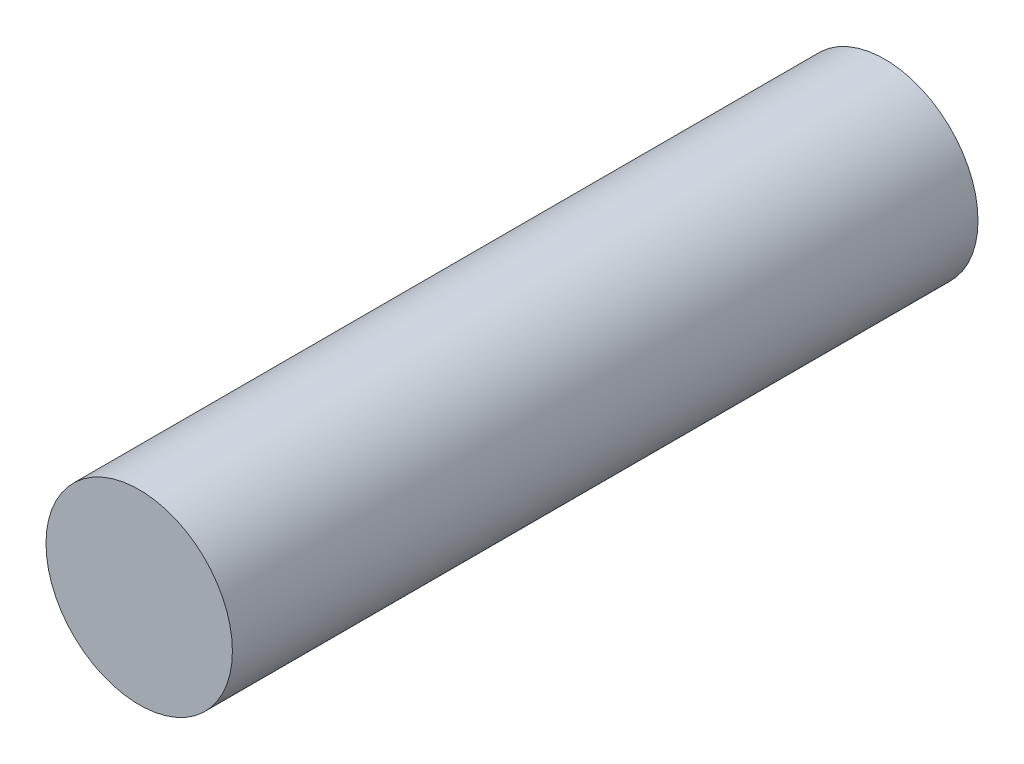
ISO-10303-21;
HEADER;
FILE_DESCRIPTION(('STEP AP214'),'2;1');
FILE_NAME('part.step','',(''),(''),'','','');
FILE_SCHEMA(('AUTOMOTIVE_DESIGN { 1 0 10303 214 1 1 1 1 }'));
ENDSEC;
DATA;
#1=APPLICATION_CONTEXT('core data for automotive mechanical design processes');
#2=APPLICATION_PROTOCOL_DEFINITION('international standard','automotive_design',2000,#1);
#3=PRODUCT_CONTEXT('',#1,'mechanical');
#4=PRODUCT('Part','Part','',(#3));
#5=PRODUCT_RELATED_PRODUCT_CATEGORY('part','',(#4));
#6=PRODUCT_DEFINITION_FORMATION('','',#4);
#7=PRODUCT_DEFINITION_CONTEXT('part definition',#1,'design');
#8=PRODUCT_DEFINITION('design','',#6,#7);
#9=PRODUCT_DEFINITION_SHAPE('','',#8);
#10=(LENGTH_UNIT() NAMED_UNIT(*) SI_UNIT(.MILLI.,.METRE.));
#11=(NAMED_UNIT(*) PLANE_ANGLE_UNIT() SI_UNIT($,.RADIAN.));
#12=(NAMED_UNIT(*) SI_UNIT($,.STERADIAN.) SOLID_ANGLE_UNIT());
#13=UNCERTAINTY_MEASURE_WITH_UNIT(LENGTH_MEASURE(1.E-05),#10,'distance_accuracy_value','');
#14=(GEOMETRIC_REPRESENTATION_CONTEXT(3) GLOBAL_UNCERTAINTY_ASSIGNED_CONTEXT((#13)) GLOBAL_UNIT_ASSIGNED_CONTEXT((#10,
#11,#12)) REPRESENTATION_CONTEXT('',''));
#15=CARTESIAN_POINT('',(0.,0.,0.));
#16=DIRECTION('',(0.,0.,1.));
#17=DIRECTION('',(1.,0.,0.));
#18=AXIS2_PLACEMENT_3D('',#15,#16,#17);
#19=CARTESIAN_POINT('',(0.,0.,30.));
#20=DIRECTION('',(0.,0.,-1.));
#21=DIRECTION('',(-1.,0.,0.));
#22=AXIS2_PLACEMENT_3D('',#19,#20,#21);
#23=CYLINDRICAL_SURFACE('',#22,3.75);
#24=CARTESIAN_POINT('',(0.,0.,30.));
#25=DIRECTION('',(0.,0.,1.));
#26=DIRECTION('',(1.,0.,0.));
#27=AXIS2_PLACEMENT_3D('',#24,#25,#26);
#28=CIRCLE('',#27,3.75);
#29=CARTESIAN_POINT('',(3.75,0.,30.));
#30=VERTEX_POINT('',#29);
#31=EDGE_CURVE('E10',#30,#30,#28,.T.);
#32=ORIENTED_EDGE('',*,*,#31,.F.);
#33=EDGE_LOOP('',(#32));
#34=FACE_BOUND('',#33,.T.);
#35=CARTESIAN_POINT('',(0.,0.,0.));
#36=DIRECTION('',(0.,0.,1.));
#37=DIRECTION('',(1.,0.,0.));
#38=AXIS2_PLACEMENT_3D('',#35,#36,#37);
#39=CIRCLE('',#38,3.75);
#40=CARTESIAN_POINT('',(3.75,0.,0.));
#41=VERTEX_POINT('',#40);
#42=EDGE_CURVE('E39',#41,#41,#39,.T.);
#43=ORIENTED_EDGE('',*,*,#42,.T.);
#44=EDGE_LOOP('',(#43));
#45=FACE_BOUND('',#44,.T.);
#46=ADVANCED_FACE('F36',(#34,#45),#23,.T.);
#47=CARTESIAN_POINT('',(0.,0.,30.));
#48=DIRECTION('',(0.,0.,1.));
#49=DIRECTION('',(1.,0.,0.));
#50=AXIS2_PLACEMENT_3D('',#47,#48,#49);
#51=PLANE('',#50);
#52=ORIENTED_EDGE('',*,*,#31,.T.);
#53=EDGE_LOOP('',(#52));
#54=FACE_BOUND('',#53,.T.);
#55=ADVANCED_FACE('F51',(#54),#51,.T.);
#56=CARTESIAN_POINT('',(0.,0.,0.));
#57=DIRECTION('',(0.,0.,1.));
#58=DIRECTION('',(1.,0.,0.));
#59=AXIS2_PLACEMENT_3D('',#56,#57,#58);
#60=PLANE('',#59);
#61=ORIENTED_EDGE('',*,*,#42,.F.);
#62=EDGE_LOOP('',(#61));
#63=FACE_BOUND('',#62,.T.);
#64=ADVANCED_FACE('F49',(#63),#60,.F.);
#65=CLOSED_SHELL('',(#46,#55,#64));
#66=MANIFOLD_SOLID_BREP('B2',#65);
#67=ADVANCED_BREP_SHAPE_REPRESENTATION('',(#18,#66),#14);
#68=SHAPE_DEFINITION_REPRESENTATION(#9,#67);
ENDSEC;
END-ISO-10303-21;
